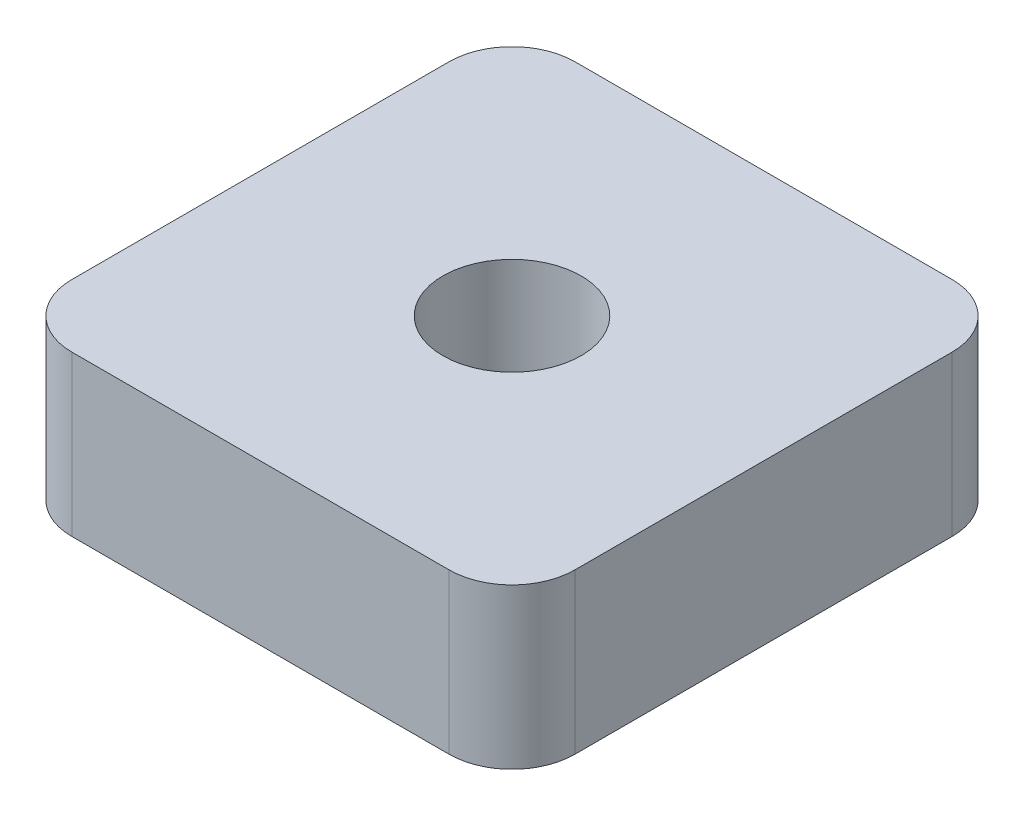
ISO-10303-21;
HEADER;
FILE_DESCRIPTION(('STEP AP214'),'2;1');
FILE_NAME('part.step','',(''),(''),'','','');
FILE_SCHEMA(('AUTOMOTIVE_DESIGN { 1 0 10303 214 1 1 1 1 }'));
ENDSEC;
DATA;
#1=APPLICATION_CONTEXT('core data for automotive mechanical design processes');
#2=APPLICATION_PROTOCOL_DEFINITION('international standard','automotive_design',2000,#1);
#3=PRODUCT_CONTEXT('',#1,'mechanical');
#4=PRODUCT('Part','Part','',(#3));
#5=PRODUCT_RELATED_PRODUCT_CATEGORY('part','',(#4));
#6=PRODUCT_DEFINITION_FORMATION('','',#4);
#7=PRODUCT_DEFINITION_CONTEXT('part definition',#1,'design');
#8=PRODUCT_DEFINITION('design','',#6,#7);
#9=PRODUCT_DEFINITION_SHAPE('','',#8);
#10=(LENGTH_UNIT() NAMED_UNIT(*) SI_UNIT(.MILLI.,.METRE.));
#11=(NAMED_UNIT(*) PLANE_ANGLE_UNIT() SI_UNIT($,.RADIAN.));
#12=(NAMED_UNIT(*) SI_UNIT($,.STERADIAN.) SOLID_ANGLE_UNIT());
#13=UNCERTAINTY_MEASURE_WITH_UNIT(LENGTH_MEASURE(1.E-05),#10,'distance_accuracy_value','');
#14=(GEOMETRIC_REPRESENTATION_CONTEXT(3) GLOBAL_UNCERTAINTY_ASSIGNED_CONTEXT((#13)) GLOBAL_UNIT_ASSIGNED_CONTEXT((#10,
#11,#12)) REPRESENTATION_CONTEXT('',''));
#15=CARTESIAN_POINT('',(0.,0.,0.));
#16=DIRECTION('',(0.,0.,1.));
#17=DIRECTION('',(1.,0.,0.));
#18=AXIS2_PLACEMENT_3D('',#15,#16,#17);
#19=CARTESIAN_POINT('',(10.,6.35,10.));
#20=DIRECTION('',(-1.,0.,0.));
#21=DIRECTION('',(0.,0.,1.));
#22=AXIS2_PLACEMENT_3D('',#19,#20,#21);
#23=PLANE('',#22);
#24=DIRECTION('',(0.,0.,-1.));
#25=VECTOR('',#24,1.);
#26=CARTESIAN_POINT('',(10.,6.35,10.));
#27=LINE('',#26,#25);
#28=CARTESIAN_POINT('',(10.,6.35,7.5));
#29=VERTEX_POINT('',#28);
#30=CARTESIAN_POINT('',(10.,6.35,-7.5));
#31=VERTEX_POINT('',#30);
#32=EDGE_CURVE('E126',#29,#31,#27,.T.);
#33=ORIENTED_EDGE('',*,*,#32,.F.);
#34=DIRECTION('',(0.,-1.,0.));
#35=VECTOR('',#34,1.);
#36=CARTESIAN_POINT('',(10.,6.35,7.5));
#37=LINE('',#36,#35);
#38=CARTESIAN_POINT('',(10.,0.,7.5));
#39=VERTEX_POINT('',#38);
#40=EDGE_CURVE('E110',#29,#39,#37,.T.);
#41=ORIENTED_EDGE('',*,*,#40,.T.);
#42=DIRECTION('',(0.,0.,-1.));
#43=VECTOR('',#42,1.);
#44=CARTESIAN_POINT('',(10.,0.,10.));
#45=LINE('',#44,#43);
#46=CARTESIAN_POINT('',(10.,0.,-7.5));
#47=VERTEX_POINT('',#46);
#48=EDGE_CURVE('E123',#39,#47,#45,.T.);
#49=ORIENTED_EDGE('',*,*,#48,.T.);
#50=DIRECTION('',(0.,-1.,0.));
#51=VECTOR('',#50,1.);
#52=CARTESIAN_POINT('',(10.,6.35,-7.5));
#53=LINE('',#52,#51);
#54=EDGE_CURVE('E129',#47,#31,#53,.F.);
#55=ORIENTED_EDGE('',*,*,#54,.T.);
#56=EDGE_LOOP('',(#33,#41,#49,#55));
#57=FACE_BOUND('',#56,.T.);
#58=ADVANCED_FACE('F39',(#57),#23,.F.);
#59=CARTESIAN_POINT('',(-10.,6.35,-10.));
#60=DIRECTION('',(0.,0.,1.));
#61=DIRECTION('',(1.,0.,0.));
#62=AXIS2_PLACEMENT_3D('',#59,#60,#61);
#63=PLANE('',#62);
#64=DIRECTION('',(-1.,0.,0.));
#65=VECTOR('',#64,1.);
#66=CARTESIAN_POINT('',(-10.,0.,-10.));
#67=LINE('',#66,#65);
#68=CARTESIAN_POINT('',(7.5,0.,-10.));
#69=VERTEX_POINT('',#68);
#70=CARTESIAN_POINT('',(-7.5,0.,-10.));
#71=VERTEX_POINT('',#70);
#72=EDGE_CURVE('E135',#69,#71,#67,.T.);
#73=ORIENTED_EDGE('',*,*,#72,.T.);
#74=DIRECTION('',(0.,-1.,0.));
#75=VECTOR('',#74,1.);
#76=CARTESIAN_POINT('',(-7.5,6.35,-10.));
#77=LINE('',#76,#75);
#78=CARTESIAN_POINT('',(-7.5,6.35,-10.));
#79=VERTEX_POINT('',#78);
#80=EDGE_CURVE('E11',#71,#79,#77,.F.);
#81=ORIENTED_EDGE('',*,*,#80,.T.);
#82=DIRECTION('',(-1.,0.,0.));
#83=VECTOR('',#82,1.);
#84=CARTESIAN_POINT('',(-10.,6.35,-10.));
#85=LINE('',#84,#83);
#86=CARTESIAN_POINT('',(7.5,6.35,-10.));
#87=VERTEX_POINT('',#86);
#88=EDGE_CURVE('E191',#87,#79,#85,.T.);
#89=ORIENTED_EDGE('',*,*,#88,.F.);
#90=DIRECTION('',(0.,-1.,0.));
#91=VECTOR('',#90,1.);
#92=CARTESIAN_POINT('',(7.5,6.35,-10.));
#93=LINE('',#92,#91);
#94=EDGE_CURVE('E48',#87,#69,#93,.T.);
#95=ORIENTED_EDGE('',*,*,#94,.T.);
#96=EDGE_LOOP('',(#73,#81,#89,#95));
#97=FACE_BOUND('',#96,.T.);
#98=ADVANCED_FACE('F189',(#97),#63,.F.);
#99=CARTESIAN_POINT('',(-10.,6.35,10.));
#100=DIRECTION('',(1.,0.,0.));
#101=DIRECTION('',(0.,0.,-1.));
#102=AXIS2_PLACEMENT_3D('',#99,#100,#101);
#103=PLANE('',#102);
#104=DIRECTION('',(0.,0.,1.));
#105=VECTOR('',#104,1.);
#106=CARTESIAN_POINT('',(-10.,6.35,10.));
#107=LINE('',#106,#105);
#108=CARTESIAN_POINT('',(-10.,6.35,-7.5));
#109=VERTEX_POINT('',#108);
#110=CARTESIAN_POINT('',(-10.,6.35,7.5));
#111=VERTEX_POINT('',#110);
#112=EDGE_CURVE('E199',#109,#111,#107,.T.);
#113=ORIENTED_EDGE('',*,*,#112,.F.);
#114=DIRECTION('',(0.,-1.,0.));
#115=VECTOR('',#114,1.);
#116=CARTESIAN_POINT('',(-10.,6.35,-7.5));
#117=LINE('',#116,#115);
#118=CARTESIAN_POINT('',(-10.,0.,-7.5));
#119=VERTEX_POINT('',#118);
#120=EDGE_CURVE('E181',#109,#119,#117,.T.);
#121=ORIENTED_EDGE('',*,*,#120,.T.);
#122=DIRECTION('',(0.,0.,1.));
#123=VECTOR('',#122,1.);
#124=CARTESIAN_POINT('',(-10.,0.,10.));
#125=LINE('',#124,#123);
#126=CARTESIAN_POINT('',(-10.,0.,7.5));
#127=VERTEX_POINT('',#126);
#128=EDGE_CURVE('E141',#119,#127,#125,.T.);
#129=ORIENTED_EDGE('',*,*,#128,.T.);
#130=DIRECTION('',(0.,-1.,0.));
#131=VECTOR('',#130,1.);
#132=CARTESIAN_POINT('',(-10.,6.35,7.5));
#133=LINE('',#132,#131);
#134=EDGE_CURVE('E55',#127,#111,#133,.F.);
#135=ORIENTED_EDGE('',*,*,#134,.T.);
#136=EDGE_LOOP('',(#113,#121,#129,#135));
#137=FACE_BOUND('',#136,.T.);
#138=ADVANCED_FACE('F198',(#137),#103,.F.);
#139=CARTESIAN_POINT('',(-10.,6.35,10.));
#140=DIRECTION('',(0.,0.,-1.));
#141=DIRECTION('',(-1.,0.,0.));
#142=AXIS2_PLACEMENT_3D('',#139,#140,#141);
#143=PLANE('',#142);
#144=DIRECTION('',(1.,0.,0.));
#145=VECTOR('',#144,1.);
#146=CARTESIAN_POINT('',(-10.,0.,10.));
#147=LINE('',#146,#145);
#148=CARTESIAN_POINT('',(-7.5,0.,10.));
#149=VERTEX_POINT('',#148);
#150=CARTESIAN_POINT('',(7.5,0.,10.));
#151=VERTEX_POINT('',#150);
#152=EDGE_CURVE('E152',#149,#151,#147,.T.);
#153=ORIENTED_EDGE('',*,*,#152,.T.);
#154=DIRECTION('',(0.,-1.,0.));
#155=VECTOR('',#154,1.);
#156=CARTESIAN_POINT('',(7.5,6.35,10.));
#157=LINE('',#156,#155);
#158=CARTESIAN_POINT('',(7.5,6.35,10.));
#159=VERTEX_POINT('',#158);
#160=EDGE_CURVE('E111',#151,#159,#157,.F.);
#161=ORIENTED_EDGE('',*,*,#160,.T.);
#162=DIRECTION('',(1.,0.,0.));
#163=VECTOR('',#162,1.);
#164=CARTESIAN_POINT('',(-10.,6.35,10.));
#165=LINE('',#164,#163);
#166=CARTESIAN_POINT('',(-7.5,6.35,10.));
#167=VERTEX_POINT('',#166);
#168=EDGE_CURVE('E147',#167,#159,#165,.T.);
#169=ORIENTED_EDGE('',*,*,#168,.F.);
#170=DIRECTION('',(0.,-1.,0.));
#171=VECTOR('',#170,1.);
#172=CARTESIAN_POINT('',(-7.5,6.35,10.));
#173=LINE('',#172,#171);
#174=EDGE_CURVE('E117',#167,#149,#173,.T.);
#175=ORIENTED_EDGE('',*,*,#174,.T.);
#176=EDGE_LOOP('',(#153,#161,#169,#175));
#177=FACE_BOUND('',#176,.T.);
#178=ADVANCED_FACE('F217',(#177),#143,.F.);
#179=CARTESIAN_POINT('',(0.,6.35,0.));
#180=DIRECTION('',(0.,-1.,0.));
#181=DIRECTION('',(0.,0.,-1.));
#182=AXIS2_PLACEMENT_3D('',#179,#180,#181);
#183=PLANE('',#182);
#184=CARTESIAN_POINT('',(0.,6.35,0.));
#185=DIRECTION('',(0.,1.,0.));
#186=DIRECTION('',(0.,0.,1.));
#187=AXIS2_PLACEMENT_3D('',#184,#185,#186);
#188=CIRCLE('',#187,2.75);
#189=CARTESIAN_POINT('',(0.,6.35,2.75));
#190=VERTEX_POINT('',#189);
#191=EDGE_CURVE('E144',#190,#190,#188,.T.);
#192=ORIENTED_EDGE('',*,*,#191,.F.);
#193=EDGE_LOOP('',(#192));
#194=FACE_BOUND('',#193,.T.);
#195=ORIENTED_EDGE('',*,*,#168,.T.);
#196=CARTESIAN_POINT('',(7.5,6.35,7.5));
#197=DIRECTION('',(0.,-1.,0.));
#198=DIRECTION('',(0.,0.,-1.));
#199=AXIS2_PLACEMENT_3D('',#196,#197,#198);
#200=CIRCLE('',#199,2.5);
#201=EDGE_CURVE('E176',#159,#29,#200,.F.);
#202=ORIENTED_EDGE('',*,*,#201,.T.);
#203=ORIENTED_EDGE('',*,*,#32,.T.);
#204=CARTESIAN_POINT('',(7.5,6.35,-7.5));
#205=DIRECTION('',(0.,-1.,0.));
#206=DIRECTION('',(0.,0.,-1.));
#207=AXIS2_PLACEMENT_3D('',#204,#205,#206);
#208=CIRCLE('',#207,2.5);
#209=EDGE_CURVE('E171',#31,#87,#208,.F.);
#210=ORIENTED_EDGE('',*,*,#209,.T.);
#211=ORIENTED_EDGE('',*,*,#88,.T.);
#212=CARTESIAN_POINT('',(-7.5,6.35,-7.5));
#213=DIRECTION('',(0.,-1.,0.));
#214=DIRECTION('',(0.,0.,-1.));
#215=AXIS2_PLACEMENT_3D('',#212,#213,#214);
#216=CIRCLE('',#215,2.5);
#217=EDGE_CURVE('E62',#79,#109,#216,.F.);
#218=ORIENTED_EDGE('',*,*,#217,.T.);
#219=ORIENTED_EDGE('',*,*,#112,.T.);
#220=CARTESIAN_POINT('',(-7.5,6.35,7.5));
#221=DIRECTION('',(0.,-1.,0.));
#222=DIRECTION('',(0.,0.,-1.));
#223=AXIS2_PLACEMENT_3D('',#220,#221,#222);
#224=CIRCLE('',#223,2.5);
#225=EDGE_CURVE('E168',#111,#167,#224,.F.);
#226=ORIENTED_EDGE('',*,*,#225,.T.);
#227=EDGE_LOOP('',(#195,#202,#203,#210,#211,#218,#219,#226));
#228=FACE_BOUND('',#227,.T.);
#229=ADVANCED_FACE('F215',(#194,#228),#183,.F.);
#230=CARTESIAN_POINT('',(0.,0.,0.));
#231=DIRECTION('',(0.,-1.,0.));
#232=DIRECTION('',(0.,0.,-1.));
#233=AXIS2_PLACEMENT_3D('',#230,#231,#232);
#234=PLANE('',#233);
#235=CARTESIAN_POINT('',(0.,0.,0.));
#236=DIRECTION('',(0.,1.,0.));
#237=DIRECTION('',(0.,0.,1.));
#238=AXIS2_PLACEMENT_3D('',#235,#236,#237);
#239=CIRCLE('',#238,2.75);
#240=CARTESIAN_POINT('',(0.,0.,2.75));
#241=VERTEX_POINT('',#240);
#242=EDGE_CURVE('E136',#241,#241,#239,.T.);
#243=ORIENTED_EDGE('',*,*,#242,.T.);
#244=EDGE_LOOP('',(#243));
#245=FACE_BOUND('',#244,.T.);
#246=ORIENTED_EDGE('',*,*,#48,.F.);
#247=CARTESIAN_POINT('',(7.5,0.,7.5));
#248=DIRECTION('',(0.,-1.,0.));
#249=DIRECTION('',(0.,0.,-1.));
#250=AXIS2_PLACEMENT_3D('',#247,#248,#249);
#251=CIRCLE('',#250,2.5);
#252=EDGE_CURVE('E106',#39,#151,#251,.T.);
#253=ORIENTED_EDGE('',*,*,#252,.T.);
#254=ORIENTED_EDGE('',*,*,#152,.F.);
#255=CARTESIAN_POINT('',(-7.5,0.,7.5));
#256=DIRECTION('',(0.,-1.,0.));
#257=DIRECTION('',(0.,0.,-1.));
#258=AXIS2_PLACEMENT_3D('',#255,#256,#257);
#259=CIRCLE('',#258,2.5);
#260=EDGE_CURVE('E128',#149,#127,#259,.T.);
#261=ORIENTED_EDGE('',*,*,#260,.T.);
#262=ORIENTED_EDGE('',*,*,#128,.F.);
#263=CARTESIAN_POINT('',(-7.5,0.,-7.5));
#264=DIRECTION('',(0.,-1.,0.));
#265=DIRECTION('',(0.,0.,-1.));
#266=AXIS2_PLACEMENT_3D('',#263,#264,#265);
#267=CIRCLE('',#266,2.5);
#268=EDGE_CURVE('E118',#119,#71,#267,.T.);
#269=ORIENTED_EDGE('',*,*,#268,.T.);
#270=ORIENTED_EDGE('',*,*,#72,.F.);
#271=CARTESIAN_POINT('',(7.5,0.,-7.5));
#272=DIRECTION('',(0.,-1.,0.));
#273=DIRECTION('',(0.,0.,-1.));
#274=AXIS2_PLACEMENT_3D('',#271,#272,#273);
#275=CIRCLE('',#274,2.5);
#276=EDGE_CURVE('E133',#69,#47,#275,.T.);
#277=ORIENTED_EDGE('',*,*,#276,.T.);
#278=EDGE_LOOP('',(#246,#253,#254,#261,#262,#269,#270,#277));
#279=FACE_BOUND('',#278,.T.);
#280=ADVANCED_FACE('F131',(#245,#279),#234,.T.);
#281=CARTESIAN_POINT('',(0.,6.35,0.));
#282=DIRECTION('',(0.,1.,0.));
#283=DIRECTION('',(0.,0.,1.));
#284=AXIS2_PLACEMENT_3D('',#281,#282,#283);
#285=CYLINDRICAL_SURFACE('',#284,2.75);
#286=ORIENTED_EDGE('',*,*,#242,.F.);
#287=EDGE_LOOP('',(#286));
#288=FACE_BOUND('',#287,.T.);
#289=ORIENTED_EDGE('',*,*,#191,.T.);
#290=EDGE_LOOP('',(#289));
#291=FACE_BOUND('',#290,.T.);
#292=ADVANCED_FACE('F213',(#288,#291),#285,.F.);
#293=CARTESIAN_POINT('',(7.5,6.35,7.5));
#294=DIRECTION('',(0.,-1.,0.));
#295=DIRECTION('',(0.,0.,-1.));
#296=AXIS2_PLACEMENT_3D('',#293,#294,#295);
#297=CYLINDRICAL_SURFACE('',#296,2.5);
#298=ORIENTED_EDGE('',*,*,#201,.F.);
#299=ORIENTED_EDGE('',*,*,#160,.F.);
#300=ORIENTED_EDGE('',*,*,#252,.F.);
#301=ORIENTED_EDGE('',*,*,#40,.F.);
#302=EDGE_LOOP('',(#298,#299,#300,#301));
#303=FACE_BOUND('',#302,.T.);
#304=ADVANCED_FACE('F109',(#303),#297,.T.);
#305=CARTESIAN_POINT('',(-7.5,6.35,-7.5));
#306=DIRECTION('',(0.,-1.,0.));
#307=DIRECTION('',(0.,0.,-1.));
#308=AXIS2_PLACEMENT_3D('',#305,#306,#307);
#309=CYLINDRICAL_SURFACE('',#308,2.5);
#310=ORIENTED_EDGE('',*,*,#217,.F.);
#311=ORIENTED_EDGE('',*,*,#80,.F.);
#312=ORIENTED_EDGE('',*,*,#268,.F.);
#313=ORIENTED_EDGE('',*,*,#120,.F.);
#314=EDGE_LOOP('',(#310,#311,#312,#313));
#315=FACE_BOUND('',#314,.T.);
#316=ADVANCED_FACE('F197',(#315),#309,.T.);
#317=CARTESIAN_POINT('',(7.5,6.35,-7.5));
#318=DIRECTION('',(0.,-1.,0.));
#319=DIRECTION('',(0.,0.,-1.));
#320=AXIS2_PLACEMENT_3D('',#317,#318,#319);
#321=CYLINDRICAL_SURFACE('',#320,2.5);
#322=ORIENTED_EDGE('',*,*,#209,.F.);
#323=ORIENTED_EDGE('',*,*,#54,.F.);
#324=ORIENTED_EDGE('',*,*,#276,.F.);
#325=ORIENTED_EDGE('',*,*,#94,.F.);
#326=EDGE_LOOP('',(#322,#323,#324,#325));
#327=FACE_BOUND('',#326,.T.);
#328=ADVANCED_FACE('F224',(#327),#321,.T.);
#329=CARTESIAN_POINT('',(-7.5,6.35,7.5));
#330=DIRECTION('',(0.,-1.,0.));
#331=DIRECTION('',(0.,0.,-1.));
#332=AXIS2_PLACEMENT_3D('',#329,#330,#331);
#333=CYLINDRICAL_SURFACE('',#332,2.5);
#334=ORIENTED_EDGE('',*,*,#225,.F.);
#335=ORIENTED_EDGE('',*,*,#134,.F.);
#336=ORIENTED_EDGE('',*,*,#260,.F.);
#337=ORIENTED_EDGE('',*,*,#174,.F.);
#338=EDGE_LOOP('',(#334,#335,#336,#337));
#339=FACE_BOUND('',#338,.T.);
#340=ADVANCED_FACE('F41',(#339),#333,.T.);
#341=CLOSED_SHELL('',(#58,#98,#138,#178,#229,#280,#292,#304,#316,#328,#340));
#342=MANIFOLD_SOLID_BREP('B2',#341);
#343=ADVANCED_BREP_SHAPE_REPRESENTATION('',(#18,#342),#14);
#344=SHAPE_DEFINITION_REPRESENTATION(#9,#343);
ENDSEC;
END-ISO-10303-21;
